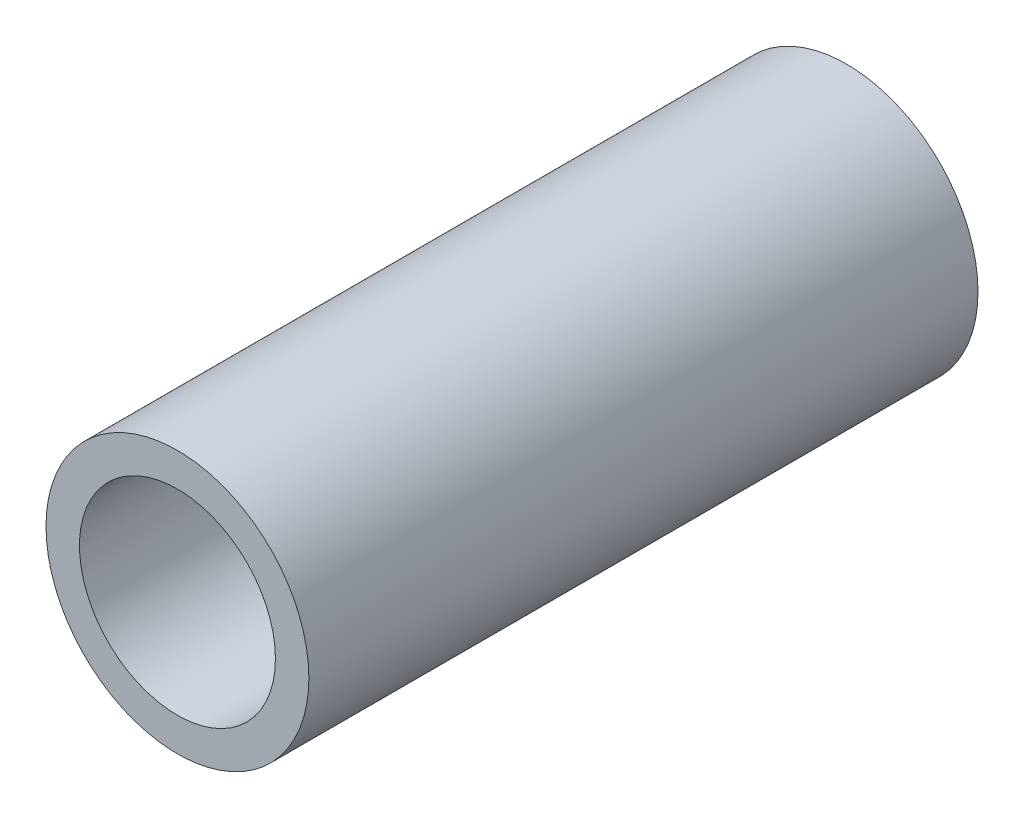
ISO-10303-21;
HEADER;
FILE_DESCRIPTION(('STEP AP214'),'2;1');
FILE_NAME('part.step','',(''),(''),'','','');
FILE_SCHEMA(('AUTOMOTIVE_DESIGN { 1 0 10303 214 1 1 1 1 }'));
ENDSEC;
DATA;
#1=APPLICATION_CONTEXT('core data for automotive mechanical design processes');
#2=APPLICATION_PROTOCOL_DEFINITION('international standard','automotive_design',2000,#1);
#3=PRODUCT_CONTEXT('',#1,'mechanical');
#4=PRODUCT('Part','Part','',(#3));
#5=PRODUCT_RELATED_PRODUCT_CATEGORY('part','',(#4));
#6=PRODUCT_DEFINITION_FORMATION('','',#4);
#7=PRODUCT_DEFINITION_CONTEXT('part definition',#1,'design');
#8=PRODUCT_DEFINITION('design','',#6,#7);
#9=PRODUCT_DEFINITION_SHAPE('','',#8);
#10=(LENGTH_UNIT() NAMED_UNIT(*) SI_UNIT(.MILLI.,.METRE.));
#11=(NAMED_UNIT(*) PLANE_ANGLE_UNIT() SI_UNIT($,.RADIAN.));
#12=(NAMED_UNIT(*) SI_UNIT($,.STERADIAN.) SOLID_ANGLE_UNIT());
#13=UNCERTAINTY_MEASURE_WITH_UNIT(LENGTH_MEASURE(1.E-05),#10,'distance_accuracy_value','');
#14=(GEOMETRIC_REPRESENTATION_CONTEXT(3) GLOBAL_UNCERTAINTY_ASSIGNED_CONTEXT((#13)) GLOBAL_UNIT_ASSIGNED_CONTEXT((#10,
#11,#12)) REPRESENTATION_CONTEXT('',''));
#15=CARTESIAN_POINT('',(0.,0.,0.));
#16=DIRECTION('',(0.,0.,1.));
#17=DIRECTION('',(1.,0.,0.));
#18=AXIS2_PLACEMENT_3D('',#15,#16,#17);
#19=CARTESIAN_POINT('',(0.,0.,28.));
#20=DIRECTION('',(0.,0.,1.));
#21=DIRECTION('',(1.,0.,0.));
#22=AXIS2_PLACEMENT_3D('',#19,#20,#21);
#23=PLANE('',#22);
#24=CARTESIAN_POINT('',(0.,0.,28.));
#25=DIRECTION('',(0.,0.,1.));
#26=DIRECTION('',(1.,0.,0.));
#27=AXIS2_PLACEMENT_3D('',#24,#25,#26);
#28=CIRCLE('',#27,5.5);
#29=CARTESIAN_POINT('',(5.5,0.,28.));
#30=VERTEX_POINT('',#29);
#31=EDGE_CURVE('E10',#30,#30,#28,.T.);
#32=ORIENTED_EDGE('',*,*,#31,.T.);
#33=EDGE_LOOP('',(#32));
#34=FACE_BOUND('',#33,.T.);
#35=CARTESIAN_POINT('',(0.,0.,28.));
#36=DIRECTION('',(0.,0.,1.));
#37=DIRECTION('',(1.,0.,0.));
#38=AXIS2_PLACEMENT_3D('',#35,#36,#37);
#39=CIRCLE('',#38,4.1);
#40=CARTESIAN_POINT('',(4.1,0.,28.));
#41=VERTEX_POINT('',#40);
#42=EDGE_CURVE('E42',#41,#41,#39,.T.);
#43=ORIENTED_EDGE('',*,*,#42,.F.);
#44=EDGE_LOOP('',(#43));
#45=FACE_BOUND('',#44,.T.);
#46=ADVANCED_FACE('F31',(#34,#45),#23,.T.);
#47=CARTESIAN_POINT('',(0.,0.,0.));
#48=DIRECTION('',(0.,0.,1.));
#49=DIRECTION('',(1.,0.,0.));
#50=AXIS2_PLACEMENT_3D('',#47,#48,#49);
#51=PLANE('',#50);
#52=CARTESIAN_POINT('',(0.,0.,0.));
#53=DIRECTION('',(0.,0.,1.));
#54=DIRECTION('',(1.,0.,0.));
#55=AXIS2_PLACEMENT_3D('',#52,#53,#54);
#56=CIRCLE('',#55,5.5);
#57=CARTESIAN_POINT('',(5.5,0.,0.));
#58=VERTEX_POINT('',#57);
#59=EDGE_CURVE('E35',#58,#58,#56,.T.);
#60=ORIENTED_EDGE('',*,*,#59,.F.);
#61=EDGE_LOOP('',(#60));
#62=FACE_BOUND('',#61,.T.);
#63=CARTESIAN_POINT('',(0.,0.,0.));
#64=DIRECTION('',(0.,0.,1.));
#65=DIRECTION('',(1.,0.,0.));
#66=AXIS2_PLACEMENT_3D('',#63,#64,#65);
#67=CIRCLE('',#66,4.1);
#68=CARTESIAN_POINT('',(4.1,0.,0.));
#69=VERTEX_POINT('',#68);
#70=EDGE_CURVE('E44',#69,#69,#67,.T.);
#71=ORIENTED_EDGE('',*,*,#70,.T.);
#72=EDGE_LOOP('',(#71));
#73=FACE_BOUND('',#72,.T.);
#74=ADVANCED_FACE('F54',(#62,#73),#51,.F.);
#75=CARTESIAN_POINT('',(0.,0.,28.));
#76=DIRECTION('',(0.,0.,-1.));
#77=DIRECTION('',(-1.,0.,0.));
#78=AXIS2_PLACEMENT_3D('',#75,#76,#77);
#79=CYLINDRICAL_SURFACE('',#78,5.5);
#80=ORIENTED_EDGE('',*,*,#31,.F.);
#81=EDGE_LOOP('',(#80));
#82=FACE_BOUND('',#81,.T.);
#83=ORIENTED_EDGE('',*,*,#59,.T.);
#84=EDGE_LOOP('',(#83));
#85=FACE_BOUND('',#84,.T.);
#86=ADVANCED_FACE('F33',(#82,#85),#79,.T.);
#87=CARTESIAN_POINT('',(0.,0.,28.));
#88=DIRECTION('',(0.,0.,-1.));
#89=DIRECTION('',(-1.,0.,0.));
#90=AXIS2_PLACEMENT_3D('',#87,#88,#89);
#91=CYLINDRICAL_SURFACE('',#90,4.1);
#92=ORIENTED_EDGE('',*,*,#42,.T.);
#93=EDGE_LOOP('',(#92));
#94=FACE_BOUND('',#93,.T.);
#95=ORIENTED_EDGE('',*,*,#70,.F.);
#96=EDGE_LOOP('',(#95));
#97=FACE_BOUND('',#96,.T.);
#98=ADVANCED_FACE('F50',(#94,#97),#91,.F.);
#99=CLOSED_SHELL('',(#46,#74,#86,#98));
#100=MANIFOLD_SOLID_BREP('B2',#99);
#101=ADVANCED_BREP_SHAPE_REPRESENTATION('',(#18,#100),#14);
#102=SHAPE_DEFINITION_REPRESENTATION(#9,#101);
ENDSEC;
END-ISO-10303-21;
